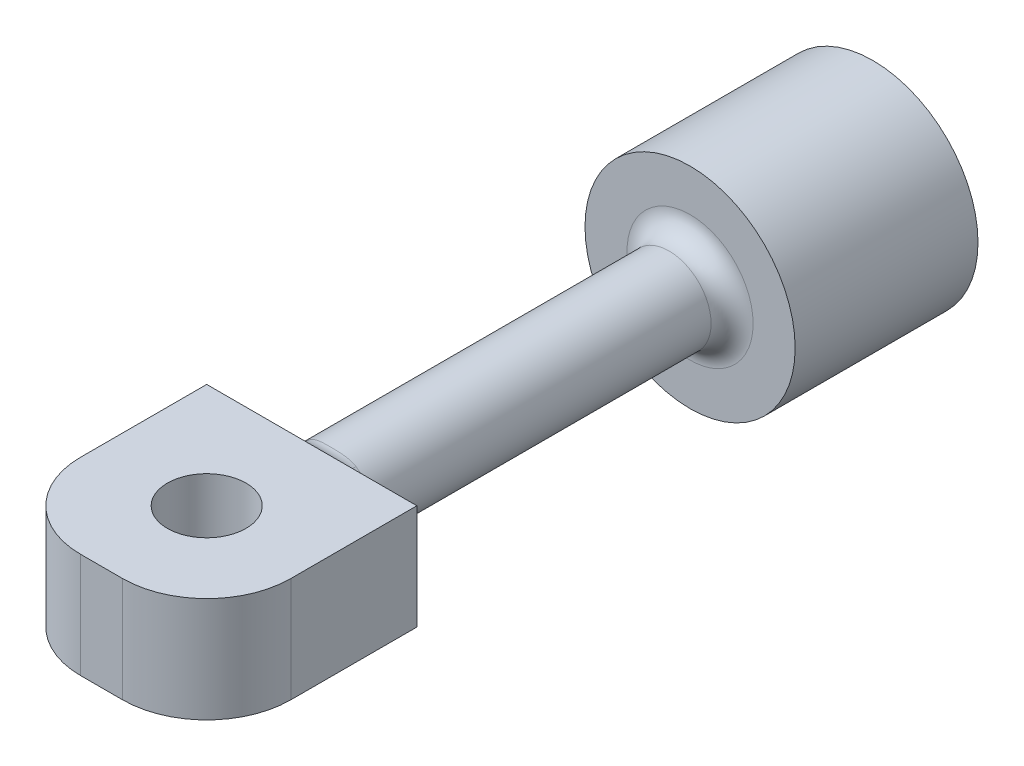
ISO-10303-21;
HEADER;
FILE_DESCRIPTION(('STEP AP214'),'2;1');
FILE_NAME('part.step','',(''),(''),'','','');
FILE_SCHEMA(('AUTOMOTIVE_DESIGN { 1 0 10303 214 1 1 1 1 }'));
ENDSEC;
DATA;
#1=APPLICATION_CONTEXT('core data for automotive mechanical design processes');
#2=APPLICATION_PROTOCOL_DEFINITION('international standard','automotive_design',2000,#1);
#3=PRODUCT_CONTEXT('',#1,'mechanical');
#4=PRODUCT('Part','Part','',(#3));
#5=PRODUCT_RELATED_PRODUCT_CATEGORY('part','',(#4));
#6=PRODUCT_DEFINITION_FORMATION('','',#4);
#7=PRODUCT_DEFINITION_CONTEXT('part definition',#1,'design');
#8=PRODUCT_DEFINITION('design','',#6,#7);
#9=PRODUCT_DEFINITION_SHAPE('','',#8);
#10=(LENGTH_UNIT() NAMED_UNIT(*) SI_UNIT(.MILLI.,.METRE.));
#11=(NAMED_UNIT(*) PLANE_ANGLE_UNIT() SI_UNIT($,.RADIAN.));
#12=(NAMED_UNIT(*) SI_UNIT($,.STERADIAN.) SOLID_ANGLE_UNIT());
#13=UNCERTAINTY_MEASURE_WITH_UNIT(LENGTH_MEASURE(1.E-05),#10,'distance_accuracy_value','');
#14=(GEOMETRIC_REPRESENTATION_CONTEXT(3) GLOBAL_UNCERTAINTY_ASSIGNED_CONTEXT((#13)) GLOBAL_UNIT_ASSIGNED_CONTEXT((#10,
#11,#12)) REPRESENTATION_CONTEXT('',''));
#15=CARTESIAN_POINT('',(0.,0.,0.));
#16=DIRECTION('',(0.,0.,1.));
#17=DIRECTION('',(1.,0.,0.));
#18=AXIS2_PLACEMENT_3D('',#15,#16,#17);
#19=CARTESIAN_POINT('',(0.,0.,33.909));
#20=DIRECTION('',(0.,0.,1.));
#21=DIRECTION('',(1.,0.,0.));
#22=AXIS2_PLACEMENT_3D('',#19,#20,#21);
#23=PLANE('',#22);
#24=DIRECTION('',(-1.,0.,0.));
#25=VECTOR('',#24,1.);
#26=CARTESIAN_POINT('',(-6.35,3.175,33.909));
#27=LINE('',#26,#25);
#28=CARTESIAN_POINT('',(-2.10605674187568,3.175,33.909));
#29=VERTEX_POINT('',#28);
#30=CARTESIAN_POINT('',(-6.35,3.175,33.909));
#31=VERTEX_POINT('',#30);
#32=EDGE_CURVE('E150',#29,#31,#27,.T.);
#33=ORIENTED_EDGE('',*,*,#32,.F.);
#34=CARTESIAN_POINT('',(0.,0.,33.909));
#35=DIRECTION('',(0.,0.,1.));
#36=DIRECTION('',(1.,0.,0.));
#37=AXIS2_PLACEMENT_3D('',#34,#35,#36);
#38=CIRCLE('',#37,3.81);
#39=CARTESIAN_POINT('',(-2.10605674187568,-3.175,33.909));
#40=VERTEX_POINT('',#39);
#41=EDGE_CURVE('E11',#29,#40,#38,.T.);
#42=ORIENTED_EDGE('',*,*,#41,.T.);
#43=DIRECTION('',(1.,0.,0.));
#44=VECTOR('',#43,1.);
#45=CARTESIAN_POINT('',(-6.35,-3.175,33.909));
#46=LINE('',#45,#44);
#47=CARTESIAN_POINT('',(-6.35,-3.175,33.909));
#48=VERTEX_POINT('',#47);
#49=EDGE_CURVE('E171',#48,#40,#46,.T.);
#50=ORIENTED_EDGE('',*,*,#49,.F.);
#51=DIRECTION('',(0.,-1.,0.));
#52=VECTOR('',#51,1.);
#53=CARTESIAN_POINT('',(-6.35,3.175,33.909));
#54=LINE('',#53,#52);
#55=EDGE_CURVE('E147',#31,#48,#54,.T.);
#56=ORIENTED_EDGE('',*,*,#55,.F.);
#57=EDGE_LOOP('',(#33,#42,#50,#56));
#58=FACE_BOUND('',#57,.T.);
#59=ADVANCED_FACE('F44',(#58),#23,.F.);
#60=CARTESIAN_POINT('',(0.,0.,11.049));
#61=DIRECTION('',(0.,0.,-1.));
#62=DIRECTION('',(-1.,0.,0.));
#63=AXIS2_PLACEMENT_3D('',#60,#61,#62);
#64=CYLINDRICAL_SURFACE('',#63,6.35);
#65=CARTESIAN_POINT('',(0.,0.,11.049));
#66=DIRECTION('',(0.,0.,1.));
#67=DIRECTION('',(1.,0.,0.));
#68=AXIS2_PLACEMENT_3D('',#65,#66,#67);
#69=CIRCLE('',#68,6.35);
#70=CARTESIAN_POINT('',(6.35,0.,11.049));
#71=VERTEX_POINT('',#70);
#72=EDGE_CURVE('E185',#71,#71,#69,.T.);
#73=ORIENTED_EDGE('',*,*,#72,.F.);
#74=EDGE_LOOP('',(#73));
#75=FACE_BOUND('',#74,.T.);
#76=CARTESIAN_POINT('',(0.,0.,0.));
#77=DIRECTION('',(0.,0.,1.));
#78=DIRECTION('',(1.,0.,0.));
#79=AXIS2_PLACEMENT_3D('',#76,#77,#78);
#80=CIRCLE('',#79,6.35);
#81=CARTESIAN_POINT('',(6.35,0.,0.));
#82=VERTEX_POINT('',#81);
#83=EDGE_CURVE('E140',#82,#82,#80,.T.);
#84=ORIENTED_EDGE('',*,*,#83,.T.);
#85=EDGE_LOOP('',(#84));
#86=FACE_BOUND('',#85,.T.);
#87=ADVANCED_FACE('F362',(#75,#86),#64,.T.);
#88=CARTESIAN_POINT('',(0.,0.,11.049));
#89=DIRECTION('',(0.,0.,1.));
#90=DIRECTION('',(1.,0.,0.));
#91=AXIS2_PLACEMENT_3D('',#88,#89,#90);
#92=PLANE('',#91);
#93=CARTESIAN_POINT('',(0.,0.,11.049));
#94=DIRECTION('',(0.,0.,1.));
#95=DIRECTION('',(1.,0.,0.));
#96=AXIS2_PLACEMENT_3D('',#93,#94,#95);
#97=CIRCLE('',#96,3.81);
#98=CARTESIAN_POINT('',(3.81,0.,11.049));
#99=VERTEX_POINT('',#98);
#100=EDGE_CURVE('E307',#99,#99,#97,.F.);
#101=ORIENTED_EDGE('',*,*,#100,.T.);
#102=EDGE_LOOP('',(#101));
#103=FACE_BOUND('',#102,.T.);
#104=ORIENTED_EDGE('',*,*,#72,.T.);
#105=EDGE_LOOP('',(#104));
#106=FACE_BOUND('',#105,.T.);
#107=ADVANCED_FACE('F366',(#103,#106),#92,.T.);
#108=CARTESIAN_POINT('',(0.,0.,0.));
#109=DIRECTION('',(0.,0.,1.));
#110=DIRECTION('',(1.,0.,0.));
#111=AXIS2_PLACEMENT_3D('',#108,#109,#110);
#112=PLANE('',#111);
#113=ORIENTED_EDGE('',*,*,#83,.F.);
#114=EDGE_LOOP('',(#113));
#115=FACE_BOUND('',#114,.T.);
#116=ADVANCED_FACE('F371',(#115),#112,.F.);
#117=CARTESIAN_POINT('',(0.,0.,33.909));
#118=DIRECTION('',(0.,0.,-1.));
#119=DIRECTION('',(-1.,0.,0.));
#120=AXIS2_PLACEMENT_3D('',#117,#118,#119);
#121=CYLINDRICAL_SURFACE('',#120,2.54);
#122=CARTESIAN_POINT('',(0.,0.,12.319));
#123=DIRECTION('',(0.,0.,1.));
#124=DIRECTION('',(1.,0.,0.));
#125=AXIS2_PLACEMENT_3D('',#122,#123,#124);
#126=CIRCLE('',#125,2.54);
#127=CARTESIAN_POINT('',(2.54,0.,12.319));
#128=VERTEX_POINT('',#127);
#129=EDGE_CURVE('E311',#128,#128,#126,.T.);
#130=ORIENTED_EDGE('',*,*,#129,.T.);
#131=EDGE_LOOP('',(#130));
#132=FACE_BOUND('',#131,.T.);
#133=CARTESIAN_POINT('',(2.75747346033165,3.175,33.909));
#134=CARTESIAN_POINT('',(1.45075360666102,2.15924582636556,34.3925103205279));
#135=CARTESIAN_POINT('',(1.8383156402211,1.75276798433748,32.762287335359));
#136=CARTESIAN_POINT('',(2.72145797705879,3.175,33.909));
#137=CARTESIAN_POINT('',(1.4619449534235,2.1364571380609,34.3627104337745));
#138=CARTESIAN_POINT('',(1.81430531803398,1.77796123271911,32.7443061096109));
#139=CARTESIAN_POINT('',(2.68412922378728,3.175,33.909));
#140=CARTESIAN_POINT('',(1.47073248027829,2.11840312635964,34.3306632550964));
#141=CARTESIAN_POINT('',(1.78941948251894,1.80301384779414,32.7287001018676));
#142=CARTESIAN_POINT('',(2.60721213015224,3.175,33.909));
#143=CARTESIAN_POINT('',(1.48263257214973,2.09138260314045,34.2651764844754));
#144=CARTESIAN_POINT('',(1.73814142009749,1.85249078486686,32.7017579648089));
#145=CARTESIAN_POINT('',(2.56762839040957,3.175,33.909));
#146=CARTESIAN_POINT('',(1.48588018624446,2.08220364788548,34.231802792635));
#147=CARTESIAN_POINT('',(1.71175226027164,1.87691624833565,32.6904134767656));
#148=CARTESIAN_POINT('',(2.44674360913777,3.175,33.909));
#149=CARTESIAN_POINT('',(1.48674334836591,2.06657196841838,34.1346097553019));
#150=CARTESIAN_POINT('',(1.63116240609462,1.94833753668744,32.6621789642376));
#151=CARTESIAN_POINT('',(2.3624790921311,3.175,33.909));
#152=CARTESIAN_POINT('',(1.47653785253469,2.07020606843899,34.0706978369796));
#153=CARTESIAN_POINT('',(1.57498606142162,1.99406237736209,32.6507044916589));
#154=CARTESIAN_POINT('',(2.1410703829851,3.175,33.909));
#155=CARTESIAN_POINT('',(1.42414088680289,2.10221098403041,33.9257559973822));
#156=CARTESIAN_POINT('',(1.42738025532204,2.10395038816791,32.6351701860049));
#157=CARTESIAN_POINT('',(1.99982997151836,3.175,33.909));
#158=CARTESIAN_POINT('',(1.36923366618578,2.14127021575293,33.8496502471815));
#159=CARTESIAN_POINT('',(1.33321998101189,2.16482858767716,32.6384013643611));
#160=CARTESIAN_POINT('',(1.70667074867858,3.175,33.909));
#161=CARTESIAN_POINT('',(1.22391730797736,2.22907432847525,33.7301349698206));
#162=CARTESIAN_POINT('',(1.13778049911941,2.27370249296661,32.6583169592671));
#163=CARTESIAN_POINT('',(1.55468546483664,3.175,33.909));
#164=CARTESIAN_POINT('',(1.13434514523384,2.27783580065136,33.684666092897));
#165=CARTESIAN_POINT('',(1.0364569765578,2.32160717117294,32.6750933064768));
#166=CARTESIAN_POINT('',(1.23295718880419,3.175,33.909));
#167=CARTESIAN_POINT('',(0.926866541861878,2.37010033517938,33.6155588797758));
#168=CARTESIAN_POINT('',(0.821971459202746,2.40625619806118,32.7136356489396));
#169=CARTESIAN_POINT('',(1.06270036998937,3.175,33.909));
#170=CARTESIAN_POINT('',(0.806864110490198,2.41413776676252,33.5919187450191));
#171=CARTESIAN_POINT('',(0.708466913326457,2.44208870148717,32.7356524902216));
#172=CARTESIAN_POINT('',(0.802850613272052,3.175,33.909));
#173=CARTESIAN_POINT('',(0.615600478159448,2.46650168060619,33.5681089924189));
#174=CARTESIAN_POINT('',(0.535233742181263,2.48367535672255,32.7642961639842));
#175=CARTESIAN_POINT('',(0.715600296142354,3.175,33.909));
#176=CARTESIAN_POINT('',(0.550403207057633,2.48168354496009,33.5620685227564));
#177=CARTESIAN_POINT('',(0.477066864094577,2.49550343318059,32.7731056136815));
#178=CARTESIAN_POINT('',(0.539873346842566,3.175,33.909));
#179=CARTESIAN_POINT('',(0.417599545586189,2.50699110839662,33.5527188341097));
#180=CARTESIAN_POINT('',(0.359915564561384,2.51507142565873,32.7882674505011));
#181=CARTESIAN_POINT('',(0.451397155316291,3.175,33.909));
#182=CARTESIAN_POINT('',(0.34977097576357,2.51721062537906,33.5493668970072));
#183=CARTESIAN_POINT('',(0.300931436877421,2.52281277344814,32.7946206979351));
#184=CARTESIAN_POINT('',(0.257633820372502,3.175,33.909));
#185=CARTESIAN_POINT('',(0.20052219015659,2.53350557205262,33.5442223062246));
#186=CARTESIAN_POINT('',(0.171755880248457,2.53515927163514,32.8049249501876));
#187=CARTESIAN_POINT('',(0.152191542896029,3.175,33.909));
#188=CARTESIAN_POINT('',(0.118388680708993,2.53859571542163,33.5427881251985));
#189=CARTESIAN_POINT('',(0.101461028597438,2.53894743153238,32.808236395569));
#190=CARTESIAN_POINT('',(-0.0588439476512452,3.175,33.909));
#191=CARTESIAN_POINT('',(-0.0457236454247866,2.54089515488794,33.5421241175975));
#192=CARTESIAN_POINT('',(-0.0392292984342492,2.54067137423043,32.8097290540229));
#193=CARTESIAN_POINT('',(-0.164437172904387,3.175,33.909));
#194=CARTESIAN_POINT('',(-0.128144441372206,2.53811621016374,33.5428909457727));
#195=CARTESIAN_POINT('',(-0.109624781936479,2.53860665450393,32.8079098265766));
#196=CARTESIAN_POINT('',(-0.375134437884289,3.175,33.909));
#197=CARTESIAN_POINT('',(-0.291191200794401,2.52489593997202,33.5469030657575));
#198=CARTESIAN_POINT('',(-0.250089625255972,2.52864167150419,32.7994527065369));
#199=CARTESIAN_POINT('',(-0.480235902219539,3.175,33.909));
#200=CARTESIAN_POINT('',(-0.372241171557344,2.51435942355359,33.5501784384892));
#201=CARTESIAN_POINT('',(-0.320157268145559,2.52072311386589,32.7927997086069));
#202=CARTESIAN_POINT('',(-0.688772361635576,3.175,33.909));
#203=CARTESIAN_POINT('',(-0.530475009564656,2.48633248453244,33.5602337205924));
#204=CARTESIAN_POINT('',(-0.459181574423796,2.49914052659052,32.7758264506634));
#205=CARTESIAN_POINT('',(-0.792207253663055,3.175,33.909));
#206=CARTESIAN_POINT('',(-0.608039298474719,2.468697060834,33.5670759119238));
#207=CARTESIAN_POINT('',(-0.528138169110239,2.48547614306246,32.7655059647719));
#208=CARTESIAN_POINT('',(-1.08102047728346,3.175,33.909));
#209=CARTESIAN_POINT('',(-0.820428628133336,2.41018525109081,33.5937840228559));
#210=CARTESIAN_POINT('',(-0.720680318186171,2.43897203089037,32.7335645468445));
#211=CARTESIAN_POINT('',(-1.26383869884293,3.175,33.909));
#212=CARTESIAN_POINT('',(-0.948845354349257,2.36181615097928,33.6200650298272));
#213=CARTESIAN_POINT('',(-0.842559132546411,2.39960403191938,32.7096298567921));
#214=CARTESIAN_POINT('',(-1.61836923396855,3.175,33.909));
#215=CARTESIAN_POINT('',(-1.17397398571186,2.25823492815116,33.7015655950387));
#216=CARTESIAN_POINT('',(-1.07891282266116,2.3029852734753,32.6678481808692));
#217=CARTESIAN_POINT('',(-1.79013250310725,3.175,33.909));
#218=CARTESIAN_POINT('',(-1.27118984233523,2.20186556768394,33.7587127825564));
#219=CARTESIAN_POINT('',(-1.19342166879709,2.24582490508662,32.6499713570588));
#220=CARTESIAN_POINT('',(-2.0566142211182,3.175,33.909));
#221=CARTESIAN_POINT('',(-1.38914589027986,2.12717702306518,33.8803251554777));
#222=CARTESIAN_POINT('',(-1.37107614737573,2.13962315517979,32.6380108959743));
#223=CARTESIAN_POINT('',(-2.15568332115343,3.175,33.909));
#224=CARTESIAN_POINT('',(-1.42513559033852,2.10219868982999,33.9356213641979));
#225=CARTESIAN_POINT('',(-1.43712221399043,2.09583194074454,32.6374439142818));
#226=CARTESIAN_POINT('',(-2.29937534719872,3.175,33.909));
#227=CARTESIAN_POINT('',(-1.46182244061619,2.07900024101459,34.0274930819406));
#228=CARTESIAN_POINT('',(-1.53291689806266,2.02567263231361,32.6458611282743));
#229=CARTESIAN_POINT('',(-2.34662112284787,3.175,33.909));
#230=CARTESIAN_POINT('',(-1.47119060673998,2.07367961547336,34.0604137288786));
#231=CARTESIAN_POINT('',(-1.56441408186909,2.00144186745873,32.6502454036791));
#232=CARTESIAN_POINT('',(-2.43913130996258,3.175,33.909));
#233=CARTESIAN_POINT('',(-1.48366955631215,2.06969009583306,34.1286792504366));
#234=CARTESIAN_POINT('',(-1.62608753999992,1.95167075755933,32.6627751978397));
#235=CARTESIAN_POINT('',(-2.48439247491016,3.175,33.909));
#236=CARTESIAN_POINT('',(-1.48661398449224,2.07119839725305,34.1640913822208));
#237=CARTESIAN_POINT('',(-1.65626164997896,1.92612840501469,32.6709266449294));
#238=CARTESIAN_POINT('',(-2.52848744698442,3.175,33.909));
#239=CARTESIAN_POINT('',(-1.48616480332682,2.07702560245629,34.1995970549083));
#240=CARTESIAN_POINT('',(-1.68565829798961,1.90004107913981,32.6812724046579));
#241=(BOUNDED_SURFACE() B_SPLINE_SURFACE(3,2,((#133,#134,#135),(#136,#137,#138),(#139,#140,
#141),(#142,#143,#144),(#145,#146,#147),(#148,#149,#150),(#151,#152,#153),(#154,#155,#156),
(#157,#158,#159),(#160,#161,#162),(#163,#164,#165),(#166,#167,#168),(#169,#170,#171),(#172,#173,
#174),(#175,#176,#177),(#178,#179,#180),(#181,#182,#183),(#184,#185,#186),(#187,#188,#189),
(#190,#191,#192),(#193,#194,#195),(#196,#197,#198),(#199,#200,#201),(#202,#203,#204),(#205,#206,
#207),(#208,#209,#210),(#211,#212,#213),(#214,#215,#216),(#217,#218,#219),(#220,#221,#222),
(#223,#224,#225),(#226,#227,#228),(#229,#230,#231),(#232,#233,#234),(#235,#236,#237),(#238,#239,
#240)),.UNSPECIFIED.,.F.,.F.,.F.) B_SPLINE_SURFACE_WITH_KNOTS((4,2,2,2,2,2,2,2,2,2,2,2,2,2,2,2,
2,4),(3,3),(0.,0.165478964280865,0.330631634870746,0.657187123329499,1.15911064900215,
1.66446964051091,2.20221153747686,2.47042166305056,2.73853775979549,3.05498965599523,
3.37146872352753,3.68894105243304,4.00643293763199,4.58500515335889,5.16068472701099,
5.51628394310174,5.69542592105601,5.87485077670779),(0.,1.),
.UNSPECIFIED.) GEOMETRIC_REPRESENTATION_ITEM() RATIONAL_B_SPLINE_SURFACE(((1.,0.593046572981363,
1.),(1.,0.599903529057048,1.),(1.,0.606980350720252,1.),(1.,0.621392399509858,1.),(1.,
0.628727089593793,1.),(1.,0.650721583165667,1.),(1.,0.665534782996795,1.),(1.,0.702309478093336,
1.),(1.,0.723837732724251,1.),(1.,0.763359635592699,1.),(1.,0.781328082295264,1.),(1.,
0.81353929178972,1.),(1.,0.827469535836317,1.),(1.,0.84375223507824,1.),(1.,0.848408111753961,
1.),(1.,0.856131724328274,1.),(1.,0.859200016423386,1.),(1.,0.864098930789858,1.),(1.,
0.865606705247396,1.),(1.,0.866292473729694,1.),(1.,0.865470267702701,1.),(1.,0.861511666313443,
1.),(1.,0.858368016026511,1.),(1.,0.849840328339414,1.),(1.,0.844456152943346,1.),(1.,
0.826251623547143,1.),(1.,0.810957187187147,1.),(1.,0.774307157851412,1.),(1.,0.752982250667473,
1.),(1.,0.715018996161015,1.),(1.,0.699705643124637,1.),(1.,0.676076182482073,1.),(1.,
0.668058615733603,1.),(1.,0.651959945216799,1.),(1.,0.643878761110568,1.),(1.,0.635848556141678,1.))) REPRESENTATION_ITEM('') SURFACE());
#242=CARTESIAN_POINT('',(-1.68565829798961,1.90004107913981,32.6812724046579));
#243=CARTESIAN_POINT('',(-1.65626164997896,1.92612840501469,32.6709266449294));
#244=CARTESIAN_POINT('',(-1.62608753999992,1.95167075755933,32.6627751978397));
#245=CARTESIAN_POINT('',(-1.56441408186909,2.00144186745873,32.6502454036791));
#246=CARTESIAN_POINT('',(-1.53291689806266,2.02567263231361,32.6458611282743));
#247=CARTESIAN_POINT('',(-1.43712221399043,2.09583194074454,32.6374439142818));
#248=CARTESIAN_POINT('',(-1.37107614737573,2.13962315517979,32.6380108959743));
#249=CARTESIAN_POINT('',(-1.19342166879709,2.24582490508662,32.6499713570588));
#250=CARTESIAN_POINT('',(-1.07891282266116,2.3029852734753,32.6678481808692));
#251=CARTESIAN_POINT('',(-0.842559132546411,2.39960403191938,32.7096298567921));
#252=CARTESIAN_POINT('',(-0.720680318186171,2.43897203089037,32.7335645468445));
#253=CARTESIAN_POINT('',(-0.528138169110239,2.48547614306246,32.7655059647719));
#254=CARTESIAN_POINT('',(-0.459181574423796,2.49914052659052,32.7758264506634));
#255=CARTESIAN_POINT('',(-0.320157268145559,2.52072311386589,32.7927997086069));
#256=CARTESIAN_POINT('',(-0.250089625255972,2.52864167150419,32.7994527065369));
#257=CARTESIAN_POINT('',(-0.109624781936479,2.53860665450393,32.8079098265766));
#258=CARTESIAN_POINT('',(-0.0392292984342491,2.54067137423043,32.8097290540229));
#259=CARTESIAN_POINT('',(0.101461028597438,2.53894743153238,32.808236395569));
#260=CARTESIAN_POINT('',(0.171755880248457,2.53515927163514,32.8049249501876));
#261=CARTESIAN_POINT('',(0.300931436877421,2.52281277344814,32.7946206979351));
#262=CARTESIAN_POINT('',(0.359915564561384,2.51507142565873,32.7882674505011));
#263=CARTESIAN_POINT('',(0.477066864094577,2.49550343318059,32.7731056136815));
#264=CARTESIAN_POINT('',(0.535233742181263,2.48367535672255,32.7642961639842));
#265=CARTESIAN_POINT('',(0.708466913326457,2.44208870148717,32.7356524902216));
#266=CARTESIAN_POINT('',(0.821971459202746,2.40625619806118,32.7136356489396));
#267=CARTESIAN_POINT('',(1.0364569765578,2.32160717117294,32.6750933064768));
#268=CARTESIAN_POINT('',(1.13778049911941,2.27370249296661,32.6583169592671));
#269=CARTESIAN_POINT('',(1.33321998101189,2.16482858767716,32.6384013643611));
#270=CARTESIAN_POINT('',(1.42738025532204,2.10395038816791,32.6351701860049));
#271=CARTESIAN_POINT('',(1.57498606142162,1.99406237736209,32.6507044916589));
#272=CARTESIAN_POINT('',(1.63116240609462,1.94833753668744,32.6621789642376));
#273=CARTESIAN_POINT('',(1.71175226027164,1.87691624833565,32.6904134767656));
#274=CARTESIAN_POINT('',(1.73814142009749,1.85249078486686,32.7017579648089));
#275=CARTESIAN_POINT('',(1.78941948251894,1.80301384779414,32.7287001018676));
#276=CARTESIAN_POINT('',(1.81430531803398,1.7779612327191,32.7443061096109));
#277=CARTESIAN_POINT('',(1.8383156402211,1.75276798433748,32.762287335359));
#278=B_SPLINE_CURVE_WITH_KNOTS('',3,(#242,#243,#244,#245,#246,#247,#248,#249,#250,#251,#252,
#253,#254,#255,#256,#257,#258,#259,#260,#261,#262,#263,#264,#265,#266,#267,#268,#269,#270,#271,
#272,#273,#274,#275,#276,#277),.UNSPECIFIED.,.F.,.F.,(4,2,2,2,2,2,2,2,2,2,2,2,2,2,2,2,2,4),(0.,
0.17942485565178,0.358566833606047,0.714166049696798,1.2898456233489,1.86841783907579,
2.18590972427475,2.50338205318026,2.81986112071256,3.13631301691229,3.40442911365723,
3.67263923923093,4.21038113619688,4.71574012770563,5.21766365337829,5.54421914183704,
5.70937181242692,5.87485077670779),.UNSPECIFIED.);
#279=CARTESIAN_POINT('',(-1.40403782791712,2.11666666666667,32.639));
#280=VERTEX_POINT('',#279);
#281=CARTESIAN_POINT('',(1.40403782791712,2.11666666666667,32.639));
#282=VERTEX_POINT('',#281);
#283=EDGE_CURVE('E217',#280,#282,#278,.T.);
#284=ORIENTED_EDGE('',*,*,#283,.T.);
#285=CARTESIAN_POINT('',(0.,0.,32.639));
#286=DIRECTION('',(0.,0.,1.));
#287=DIRECTION('',(1.,0.,0.));
#288=AXIS2_PLACEMENT_3D('',#285,#286,#287);
#289=CIRCLE('',#288,2.54);
#290=CARTESIAN_POINT('',(1.40403782791712,-2.11666666666667,32.639));
#291=VERTEX_POINT('',#290);
#292=EDGE_CURVE('E315',#282,#291,#289,.F.);
#293=ORIENTED_EDGE('',*,*,#292,.T.);
#294=CARTESIAN_POINT('',(-2.75747346033165,-3.175,33.909));
#295=CARTESIAN_POINT('',(-1.45075360666101,-2.15924582636556,34.3925103205279));
#296=CARTESIAN_POINT('',(-1.8383156402211,-1.75276798433748,32.762287335359));
#297=CARTESIAN_POINT('',(-2.72145797705878,-3.175,33.909));
#298=CARTESIAN_POINT('',(-1.4619449534235,-2.1364571380609,34.3627104337745));
#299=CARTESIAN_POINT('',(-1.81430531803398,-1.77796123271911,32.7443061096109));
#300=CARTESIAN_POINT('',(-2.68412922378728,-3.175,33.909));
#301=CARTESIAN_POINT('',(-1.47073248027829,-2.11840312635964,34.3306632550964));
#302=CARTESIAN_POINT('',(-1.78941948251894,-1.80301384779414,32.7287001018676));
#303=CARTESIAN_POINT('',(-2.60721213015224,-3.175,33.909));
#304=CARTESIAN_POINT('',(-1.48263257214973,-2.09138260314045,34.2651764844754));
#305=CARTESIAN_POINT('',(-1.73814142009749,-1.85249078486686,32.7017579648089));
#306=CARTESIAN_POINT('',(-2.56762839040957,-3.175,33.909));
#307=CARTESIAN_POINT('',(-1.48588018624446,-2.08220364788548,34.231802792635));
#308=CARTESIAN_POINT('',(-1.71175226027164,-1.87691624833565,32.6904134767656));
#309=CARTESIAN_POINT('',(-2.44674360913777,-3.175,33.909));
#310=CARTESIAN_POINT('',(-1.48674334836591,-2.06657196841838,34.1346097553019));
#311=CARTESIAN_POINT('',(-1.63116240609462,-1.94833753668744,32.6621789642376));
#312=CARTESIAN_POINT('',(-2.3624790921311,-3.175,33.909));
#313=CARTESIAN_POINT('',(-1.47653785253469,-2.07020606843899,34.0706978369796));
#314=CARTESIAN_POINT('',(-1.57498606142162,-1.99406237736209,32.6507044916589));
#315=CARTESIAN_POINT('',(-2.1410703829851,-3.175,33.909));
#316=CARTESIAN_POINT('',(-1.42414088680289,-2.10221098403041,33.9257559973822));
#317=CARTESIAN_POINT('',(-1.42738025532204,-2.10395038816791,32.6351701860049));
#318=CARTESIAN_POINT('',(-1.99982997151836,-3.175,33.909));
#319=CARTESIAN_POINT('',(-1.36923366618578,-2.14127021575293,33.8496502471815));
#320=CARTESIAN_POINT('',(-1.33321998101189,-2.16482858767716,32.6384013643611));
#321=CARTESIAN_POINT('',(-1.70667074867858,-3.175,33.909));
#322=CARTESIAN_POINT('',(-1.22391730797736,-2.22907432847525,33.7301349698206));
#323=CARTESIAN_POINT('',(-1.13778049911941,-2.27370249296661,32.6583169592671));
#324=CARTESIAN_POINT('',(-1.55468546483664,-3.175,33.909));
#325=CARTESIAN_POINT('',(-1.13434514523384,-2.27783580065136,33.684666092897));
#326=CARTESIAN_POINT('',(-1.0364569765578,-2.32160717117294,32.6750933064768));
#327=CARTESIAN_POINT('',(-1.23295718880419,-3.175,33.909));
#328=CARTESIAN_POINT('',(-0.926866541861877,-2.37010033517938,33.6155588797758));
#329=CARTESIAN_POINT('',(-0.821971459202746,-2.40625619806118,32.7136356489396));
#330=CARTESIAN_POINT('',(-1.06270036998937,-3.175,33.909));
#331=CARTESIAN_POINT('',(-0.806864110490197,-2.41413776676252,33.5919187450191));
#332=CARTESIAN_POINT('',(-0.708466913326456,-2.44208870148717,32.7356524902216));
#333=CARTESIAN_POINT('',(-0.802850613272051,-3.175,33.909));
#334=CARTESIAN_POINT('',(-0.615600478159447,-2.46650168060619,33.5681089924189));
#335=CARTESIAN_POINT('',(-0.535233742181263,-2.48367535672255,32.7642961639842));
#336=CARTESIAN_POINT('',(-0.715600296142354,-3.175,33.909));
#337=CARTESIAN_POINT('',(-0.550403207057633,-2.48168354496009,33.5620685227564));
#338=CARTESIAN_POINT('',(-0.477066864094577,-2.49550343318059,32.7731056136815));
#339=CARTESIAN_POINT('',(-0.539873346842567,-3.175,33.909));
#340=CARTESIAN_POINT('',(-0.417599545586189,-2.50699110839662,33.5527188341097));
#341=CARTESIAN_POINT('',(-0.359915564561385,-2.51507142565873,32.7882674505011));
#342=CARTESIAN_POINT('',(-0.451397155316291,-3.175,33.909));
#343=CARTESIAN_POINT('',(-0.34977097576357,-2.51721062537906,33.5493668970072));
#344=CARTESIAN_POINT('',(-0.300931436877421,-2.52281277344814,32.7946206979351));
#345=CARTESIAN_POINT('',(-0.257633820372501,-3.175,33.909));
#346=CARTESIAN_POINT('',(-0.200522190156589,-2.53350557205262,33.5442223062246));
#347=CARTESIAN_POINT('',(-0.171755880248456,-2.53515927163514,32.8049249501876));
#348=CARTESIAN_POINT('',(-0.152191542896028,-3.175,33.909));
#349=CARTESIAN_POINT('',(-0.118388680708992,-2.53859571542163,33.5427881251985));
#350=CARTESIAN_POINT('',(-0.101461028597438,-2.53894743153238,32.808236395569));
#351=CARTESIAN_POINT('',(0.0588439476512474,-3.175,33.909));
#352=CARTESIAN_POINT('',(0.0457236454247882,-2.54089515488794,33.5421241175976));
#353=CARTESIAN_POINT('',(0.0392292984342506,-2.54067137423043,32.8097290540229));
#354=CARTESIAN_POINT('',(0.16443717290439,-3.175,33.909));
#355=CARTESIAN_POINT('',(0.128144441372209,-2.53811621016374,33.5428909457727));
#356=CARTESIAN_POINT('',(0.10962478193648,-2.53860665450393,32.8079098265766));
#357=CARTESIAN_POINT('',(0.375134437884293,-3.175,33.909));
#358=CARTESIAN_POINT('',(0.291191200794404,-2.52489593997202,33.5469030657575));
#359=CARTESIAN_POINT('',(0.250089625255974,-2.52864167150419,32.7994527065369));
#360=CARTESIAN_POINT('',(0.480235902219543,-3.175,33.909));
#361=CARTESIAN_POINT('',(0.372241171557347,-2.5143594235536,33.5501784384892));
#362=CARTESIAN_POINT('',(0.320157268145562,-2.52072311386589,32.7927997086069));
#363=CARTESIAN_POINT('',(0.688772361635581,-3.175,33.909));
#364=CARTESIAN_POINT('',(0.53047500956466,-2.48633248453244,33.5602337205924));
#365=CARTESIAN_POINT('',(0.459181574423799,-2.49914052659052,32.7758264506634));
#366=CARTESIAN_POINT('',(0.79220725366306,-3.175,33.909));
#367=CARTESIAN_POINT('',(0.608039298474723,-2.468697060834,33.5670759119238));
#368=CARTESIAN_POINT('',(0.528138169110243,-2.48547614306246,32.7655059647719));
#369=CARTESIAN_POINT('',(1.08102047728346,-3.175,33.909));
#370=CARTESIAN_POINT('',(0.82042862813334,-2.41018525109081,33.5937840228559));
#371=CARTESIAN_POINT('',(0.720680318186175,-2.43897203089037,32.7335645468445));
#372=CARTESIAN_POINT('',(1.26383869884293,-3.175,33.909));
#373=CARTESIAN_POINT('',(0.948845354349262,-2.36181615097928,33.6200650298272));
#374=CARTESIAN_POINT('',(0.842559132546416,-2.39960403191937,32.7096298567921));
#375=CARTESIAN_POINT('',(1.61836923396856,-3.175,33.909));
#376=CARTESIAN_POINT('',(1.17397398571187,-2.25823492815116,33.7015655950387));
#377=CARTESIAN_POINT('',(1.07891282266117,-2.3029852734753,32.6678481808692));
#378=CARTESIAN_POINT('',(1.79013250310726,-3.175,33.909));
#379=CARTESIAN_POINT('',(1.27118984233523,-2.20186556768393,33.7587127825564));
#380=CARTESIAN_POINT('',(1.1934216687971,-2.24582490508662,32.6499713570588));
#381=CARTESIAN_POINT('',(2.0566142211182,-3.175,33.909));
#382=CARTESIAN_POINT('',(1.38914589027986,-2.12717702306518,33.8803251554778));
#383=CARTESIAN_POINT('',(1.37107614737574,-2.13962315517979,32.6380108959743));
#384=CARTESIAN_POINT('',(2.15568332115344,-3.175,33.909));
#385=CARTESIAN_POINT('',(1.42513559033852,-2.10219868982999,33.9356213641978));
#386=CARTESIAN_POINT('',(1.43712221399043,-2.09583194074453,32.6374439142818));
#387=CARTESIAN_POINT('',(2.29937534719873,-3.175,33.909));
#388=CARTESIAN_POINT('',(1.46182244061619,-2.07900024101459,34.0274930819406));
#389=CARTESIAN_POINT('',(1.53291689806267,-2.02567263231361,32.6458611282743));
#390=CARTESIAN_POINT('',(2.34662112284788,-3.175,33.909));
#391=CARTESIAN_POINT('',(1.47119060673998,-2.07367961547336,34.0604137288786));
#392=CARTESIAN_POINT('',(1.5644140818691,-2.00144186745872,32.6502454036791));
#393=CARTESIAN_POINT('',(2.43913130996259,-3.175,33.909));
#394=CARTESIAN_POINT('',(1.48366955631215,-2.06969009583306,34.1286792504366));
#395=CARTESIAN_POINT('',(1.62608753999993,-1.95167075755932,32.6627751978397));
#396=CARTESIAN_POINT('',(2.48439247491017,-3.175,33.909));
#397=CARTESIAN_POINT('',(1.48661398449224,-2.07119839725305,34.1640913822209));
#398=CARTESIAN_POINT('',(1.65626164997896,-1.92612840501469,32.6709266449294));
#399=CARTESIAN_POINT('',(2.52848744698443,-3.175,33.909));
#400=CARTESIAN_POINT('',(1.48616480332682,-2.07702560245629,34.1995970549083));
#401=CARTESIAN_POINT('',(1.68565829798962,-1.9000410791398,32.6812724046579));
#402=(BOUNDED_SURFACE() B_SPLINE_SURFACE(3,2,((#294,#295,#296),(#297,#298,#299),(#300,#301,
#302),(#303,#304,#305),(#306,#307,#308),(#309,#310,#311),(#312,#313,#314),(#315,#316,#317),
(#318,#319,#320),(#321,#322,#323),(#324,#325,#326),(#327,#328,#329),(#330,#331,#332),(#333,#334,
#335),(#336,#337,#338),(#339,#340,#341),(#342,#343,#344),(#345,#346,#347),(#348,#349,#350),
(#351,#352,#353),(#354,#355,#356),(#357,#358,#359),(#360,#361,#362),(#363,#364,#365),(#366,#367,
#368),(#369,#370,#371),(#372,#373,#374),(#375,#376,#377),(#378,#379,#380),(#381,#382,#383),
(#384,#385,#386),(#387,#388,#389),(#390,#391,#392),(#393,#394,#395),(#396,#397,#398),(#399,#400,
#401)),.UNSPECIFIED.,.F.,.F.,.F.) B_SPLINE_SURFACE_WITH_KNOTS((4,2,2,2,2,2,2,2,2,2,2,2,2,2,2,2,
2,4),(3,3),(0.,0.165478964280865,0.330631634870746,0.657187123329499,1.15911064900215,
1.6644696405109,2.20221153747686,2.47042166305055,2.73853775979549,3.05498965599523,
3.37146872352753,3.68894105243304,4.006432937632,4.58500515335889,5.16068472701099,
5.51628394310174,5.69542592105601,5.87485077670779),(0.,1.),
.UNSPECIFIED.) GEOMETRIC_REPRESENTATION_ITEM() RATIONAL_B_SPLINE_SURFACE(((1.,0.593046572981363,
1.),(1.,0.599903529057048,1.),(1.,0.606980350720252,1.),(1.,0.621392399509858,1.),(1.,
0.628727089593793,1.),(1.,0.650721583165667,1.),(1.,0.665534782996795,1.),(1.,0.702309478093336,
1.),(1.,0.723837732724251,1.),(1.,0.763359635592699,1.),(1.,0.781328082295265,1.),(1.,
0.813539291789719,1.),(1.,0.827469535836316,1.),(1.,0.84375223507824,1.),(1.,0.848408111753961,
1.),(1.,0.856131724328274,1.),(1.,0.859200016423385,1.),(1.,0.864098930789857,1.),(1.,
0.865606705247395,1.),(1.,0.866292473729694,1.),(1.,0.865470267702701,1.),(1.,0.861511666313443,
1.),(1.,0.858368016026511,1.),(1.,0.849840328339414,1.),(1.,0.844456152943345,1.),(1.,
0.826251623547142,1.),(1.,0.810957187187146,1.),(1.,0.774307157851411,1.),(1.,0.752982250667472,
1.),(1.,0.715018996161014,1.),(1.,0.699705643124636,1.),(1.,0.676076182482072,1.),(1.,
0.668058615733602,1.),(1.,0.651959945216798,1.),(1.,0.643878761110567,1.),(1.,0.635848556141677,1.))) REPRESENTATION_ITEM('') SURFACE());
#403=CARTESIAN_POINT('',(1.68565829798962,-1.9000410791398,32.6812724046579));
#404=CARTESIAN_POINT('',(1.65626164997896,-1.92612840501469,32.6709266449294));
#405=CARTESIAN_POINT('',(1.62608753999993,-1.95167075755932,32.6627751978397));
#406=CARTESIAN_POINT('',(1.5644140818691,-2.00144186745872,32.6502454036791));
#407=CARTESIAN_POINT('',(1.53291689806267,-2.02567263231361,32.6458611282743));
#408=CARTESIAN_POINT('',(1.43712221399043,-2.09583194074453,32.6374439142818));
#409=CARTESIAN_POINT('',(1.37107614737574,-2.13962315517979,32.6380108959743));
#410=CARTESIAN_POINT('',(1.1934216687971,-2.24582490508662,32.6499713570588));
#411=CARTESIAN_POINT('',(1.07891282266117,-2.3029852734753,32.6678481808692));
#412=CARTESIAN_POINT('',(0.842559132546416,-2.39960403191937,32.7096298567921));
#413=CARTESIAN_POINT('',(0.720680318186175,-2.43897203089037,32.7335645468445));
#414=CARTESIAN_POINT('',(0.528138169110243,-2.48547614306246,32.7655059647719));
#415=CARTESIAN_POINT('',(0.459181574423799,-2.49914052659052,32.7758264506634));
#416=CARTESIAN_POINT('',(0.320157268145562,-2.52072311386589,32.7927997086069));
#417=CARTESIAN_POINT('',(0.250089625255974,-2.52864167150419,32.7994527065369));
#418=CARTESIAN_POINT('',(0.10962478193648,-2.53860665450393,32.8079098265766));
#419=CARTESIAN_POINT('',(0.0392292984342506,-2.54067137423043,32.8097290540229));
#420=CARTESIAN_POINT('',(-0.101461028597438,-2.53894743153238,32.808236395569));
#421=CARTESIAN_POINT('',(-0.171755880248456,-2.53515927163514,32.8049249501876));
#422=CARTESIAN_POINT('',(-0.300931436877421,-2.52281277344814,32.7946206979351));
#423=CARTESIAN_POINT('',(-0.359915564561385,-2.51507142565873,32.7882674505011));
#424=CARTESIAN_POINT('',(-0.477066864094577,-2.49550343318059,32.7731056136815));
#425=CARTESIAN_POINT('',(-0.535233742181263,-2.48367535672255,32.7642961639842));
#426=CARTESIAN_POINT('',(-0.708466913326456,-2.44208870148717,32.7356524902216));
#427=CARTESIAN_POINT('',(-0.821971459202746,-2.40625619806118,32.7136356489396));
#428=CARTESIAN_POINT('',(-1.0364569765578,-2.32160717117294,32.6750933064768));
#429=CARTESIAN_POINT('',(-1.13778049911941,-2.27370249296661,32.6583169592671));
#430=CARTESIAN_POINT('',(-1.33321998101189,-2.16482858767716,32.6384013643611));
#431=CARTESIAN_POINT('',(-1.42738025532204,-2.10395038816791,32.6351701860049));
#432=CARTESIAN_POINT('',(-1.57498606142162,-1.99406237736209,32.6507044916589));
#433=CARTESIAN_POINT('',(-1.63116240609462,-1.94833753668744,32.6621789642376));
#434=CARTESIAN_POINT('',(-1.71175226027164,-1.87691624833565,32.6904134767656));
#435=CARTESIAN_POINT('',(-1.73814142009749,-1.85249078486686,32.7017579648089));
#436=CARTESIAN_POINT('',(-1.78941948251894,-1.80301384779414,32.7287001018676));
#437=CARTESIAN_POINT('',(-1.81430531803398,-1.77796123271911,32.7443061096109));
#438=CARTESIAN_POINT('',(-1.8383156402211,-1.75276798433748,32.762287335359));
#439=B_SPLINE_CURVE_WITH_KNOTS('',3,(#403,#404,#405,#406,#407,#408,#409,#410,#411,#412,#413,
#414,#415,#416,#417,#418,#419,#420,#421,#422,#423,#424,#425,#426,#427,#428,#429,#430,#431,#432,
#433,#434,#435,#436,#437,#438),.UNSPECIFIED.,.F.,.F.,(4,2,2,2,2,2,2,2,2,2,2,2,2,2,2,2,2,4),(0.,
0.17942485565178,0.358566833606046,0.714166049696795,1.2898456233489,1.86841783907579,
2.18590972427475,2.50338205318026,2.81986112071256,3.1363130169123,3.40442911365724,
3.67263923923093,4.21038113619688,4.71574012770564,5.21766365337829,5.54421914183704,
5.70937181242692,5.87485077670779),.UNSPECIFIED.);
#440=CARTESIAN_POINT('',(-1.40403782791712,-2.11666666666667,32.639));
#441=VERTEX_POINT('',#440);
#442=EDGE_CURVE('E317',#291,#441,#439,.T.);
#443=ORIENTED_EDGE('',*,*,#442,.T.);
#444=CARTESIAN_POINT('',(0.,0.,32.639));
#445=DIRECTION('',(0.,0.,1.));
#446=DIRECTION('',(1.,0.,0.));
#447=AXIS2_PLACEMENT_3D('',#444,#445,#446);
#448=CIRCLE('',#447,2.54);
#449=EDGE_CURVE('E227',#441,#280,#448,.F.);
#450=ORIENTED_EDGE('',*,*,#449,.T.);
#451=EDGE_LOOP('',(#284,#293,#443,#450));
#452=FACE_BOUND('',#451,.T.);
#453=ADVANCED_FACE('F229',(#132,#452),#121,.T.);
#454=CARTESIAN_POINT('',(6.35,3.175,46.609));
#455=DIRECTION('',(-1.,0.,0.));
#456=DIRECTION('',(0.,-1.,0.));
#457=AXIS2_PLACEMENT_3D('',#454,#455,#456);
#458=PLANE('',#457);
#459=DIRECTION('',(0.,0.,-1.));
#460=VECTOR('',#459,1.);
#461=CARTESIAN_POINT('',(6.35,3.175,46.609));
#462=LINE('',#461,#460);
#463=CARTESIAN_POINT('',(6.35,3.175,41.529));
#464=VERTEX_POINT('',#463);
#465=CARTESIAN_POINT('',(6.35,3.175,33.909));
#466=VERTEX_POINT('',#465);
#467=EDGE_CURVE('E128',#464,#466,#462,.T.);
#468=ORIENTED_EDGE('',*,*,#467,.F.);
#469=DIRECTION('',(0.,1.,0.));
#470=VECTOR('',#469,1.);
#471=CARTESIAN_POINT('',(6.35,-3.175,41.529));
#472=LINE('',#471,#470);
#473=CARTESIAN_POINT('',(6.35,-3.175,41.529));
#474=VERTEX_POINT('',#473);
#475=EDGE_CURVE('E214',#464,#474,#472,.F.);
#476=ORIENTED_EDGE('',*,*,#475,.T.);
#477=DIRECTION('',(0.,0.,-1.));
#478=VECTOR('',#477,1.);
#479=CARTESIAN_POINT('',(6.35,-3.175,46.609));
#480=LINE('',#479,#478);
#481=CARTESIAN_POINT('',(6.35,-3.175,33.909));
#482=VERTEX_POINT('',#481);
#483=EDGE_CURVE('E154',#474,#482,#480,.T.);
#484=ORIENTED_EDGE('',*,*,#483,.T.);
#485=DIRECTION('',(0.,1.,0.));
#486=VECTOR('',#485,1.);
#487=CARTESIAN_POINT('',(6.35,3.175,33.909));
#488=LINE('',#487,#486);
#489=EDGE_CURVE('E145',#482,#466,#488,.T.);
#490=ORIENTED_EDGE('',*,*,#489,.T.);
#491=EDGE_LOOP('',(#468,#476,#484,#490));
#492=FACE_BOUND('',#491,.T.);
#493=ADVANCED_FACE('F152',(#492),#458,.F.);
#494=CARTESIAN_POINT('',(-6.35,3.175,46.609));
#495=DIRECTION('',(0.,-1.,0.));
#496=DIRECTION('',(0.,0.,-1.));
#497=AXIS2_PLACEMENT_3D('',#494,#495,#496);
#498=PLANE('',#497);
#499=CARTESIAN_POINT('',(0.,3.175,40.259));
#500=DIRECTION('',(0.,-1.,0.));
#501=DIRECTION('',(0.,0.,-1.));
#502=AXIS2_PLACEMENT_3D('',#499,#500,#501);
#503=CIRCLE('',#502,2.3749);
#504=CARTESIAN_POINT('',(0.,3.175,37.8841));
#505=VERTEX_POINT('',#504);
#506=EDGE_CURVE('E156',#505,#505,#503,.T.);
#507=ORIENTED_EDGE('',*,*,#506,.T.);
#508=EDGE_LOOP('',(#507));
#509=FACE_BOUND('',#508,.T.);
#510=DIRECTION('',(0.,0.,-1.));
#511=VECTOR('',#510,1.);
#512=CARTESIAN_POINT('',(-6.35,3.175,46.609));
#513=LINE('',#512,#511);
#514=CARTESIAN_POINT('',(-6.35,3.175,41.529));
#515=VERTEX_POINT('',#514);
#516=EDGE_CURVE('E141',#515,#31,#513,.T.);
#517=ORIENTED_EDGE('',*,*,#516,.F.);
#518=CARTESIAN_POINT('',(-1.27,3.175,41.529));
#519=DIRECTION('',(0.,-1.,0.));
#520=DIRECTION('',(0.,0.,-1.));
#521=AXIS2_PLACEMENT_3D('',#518,#519,#520);
#522=CIRCLE('',#521,5.08);
#523=CARTESIAN_POINT('',(-1.27,3.175,46.609));
#524=VERTEX_POINT('',#523);
#525=EDGE_CURVE('E211',#515,#524,#522,.F.);
#526=ORIENTED_EDGE('',*,*,#525,.T.);
#527=DIRECTION('',(-1.,0.,0.));
#528=VECTOR('',#527,1.);
#529=CARTESIAN_POINT('',(-6.35,3.175,46.609));
#530=LINE('',#529,#528);
#531=CARTESIAN_POINT('',(1.27,3.175,46.609));
#532=VERTEX_POINT('',#531);
#533=EDGE_CURVE('E175',#532,#524,#530,.T.);
#534=ORIENTED_EDGE('',*,*,#533,.F.);
#535=CARTESIAN_POINT('',(1.27,3.175,41.529));
#536=DIRECTION('',(0.,-1.,0.));
#537=DIRECTION('',(0.,0.,-1.));
#538=AXIS2_PLACEMENT_3D('',#535,#536,#537);
#539=CIRCLE('',#538,5.08);
#540=EDGE_CURVE('E135',#532,#464,#539,.F.);
#541=ORIENTED_EDGE('',*,*,#540,.T.);
#542=ORIENTED_EDGE('',*,*,#467,.T.);
#543=CARTESIAN_POINT('',(2.10605674187568,3.175,33.909));
#544=VERTEX_POINT('',#543);
#545=EDGE_CURVE('E132',#466,#544,#27,.T.);
#546=ORIENTED_EDGE('',*,*,#545,.T.);
#547=EDGE_CURVE('E148',#544,#29,#27,.T.);
#548=ORIENTED_EDGE('',*,*,#547,.T.);
#549=ORIENTED_EDGE('',*,*,#32,.T.);
#550=EDGE_LOOP('',(#517,#526,#534,#541,#542,#546,#548,#549));
#551=FACE_BOUND('',#550,.T.);
#552=ADVANCED_FACE('F130',(#509,#551),#498,.F.);
#553=CARTESIAN_POINT('',(-6.35,3.175,46.609));
#554=DIRECTION('',(1.,0.,0.));
#555=DIRECTION('',(0.,1.,0.));
#556=AXIS2_PLACEMENT_3D('',#553,#554,#555);
#557=PLANE('',#556);
#558=DIRECTION('',(0.,0.,-1.));
#559=VECTOR('',#558,1.);
#560=CARTESIAN_POINT('',(-6.35,-3.175,46.609));
#561=LINE('',#560,#559);
#562=CARTESIAN_POINT('',(-6.35,-3.175,41.529));
#563=VERTEX_POINT('',#562);
#564=EDGE_CURVE('E179',#563,#48,#561,.T.);
#565=ORIENTED_EDGE('',*,*,#564,.F.);
#566=DIRECTION('',(0.,-1.,0.));
#567=VECTOR('',#566,1.);
#568=CARTESIAN_POINT('',(-6.35,3.175,41.529));
#569=LINE('',#568,#567);
#570=EDGE_CURVE('E206',#563,#515,#569,.F.);
#571=ORIENTED_EDGE('',*,*,#570,.T.);
#572=ORIENTED_EDGE('',*,*,#516,.T.);
#573=ORIENTED_EDGE('',*,*,#55,.T.);
#574=EDGE_LOOP('',(#565,#571,#572,#573));
#575=FACE_BOUND('',#574,.T.);
#576=ADVANCED_FACE('F350',(#575),#557,.F.);
#577=CARTESIAN_POINT('',(-6.35,-3.175,46.609));
#578=DIRECTION('',(0.,1.,0.));
#579=DIRECTION('',(0.,0.,1.));
#580=AXIS2_PLACEMENT_3D('',#577,#578,#579);
#581=PLANE('',#580);
#582=CARTESIAN_POINT('',(0.,-3.175,40.259));
#583=DIRECTION('',(0.,-1.,0.));
#584=DIRECTION('',(0.,0.,-1.));
#585=AXIS2_PLACEMENT_3D('',#582,#583,#584);
#586=CIRCLE('',#585,2.3749);
#587=CARTESIAN_POINT('',(0.,-3.175,37.8841));
#588=VERTEX_POINT('',#587);
#589=EDGE_CURVE('E161',#588,#588,#586,.T.);
#590=ORIENTED_EDGE('',*,*,#589,.F.);
#591=EDGE_LOOP('',(#590));
#592=FACE_BOUND('',#591,.T.);
#593=DIRECTION('',(1.,0.,0.));
#594=VECTOR('',#593,1.);
#595=CARTESIAN_POINT('',(-6.35,-3.175,46.609));
#596=LINE('',#595,#594);
#597=CARTESIAN_POINT('',(-1.27,-3.175,46.609));
#598=VERTEX_POINT('',#597);
#599=CARTESIAN_POINT('',(1.27,-3.175,46.609));
#600=VERTEX_POINT('',#599);
#601=EDGE_CURVE('E164',#598,#600,#596,.T.);
#602=ORIENTED_EDGE('',*,*,#601,.F.);
#603=CARTESIAN_POINT('',(-1.27,-3.175,41.529));
#604=DIRECTION('',(0.,1.,0.));
#605=DIRECTION('',(0.,0.,1.));
#606=AXIS2_PLACEMENT_3D('',#603,#604,#605);
#607=CIRCLE('',#606,5.08);
#608=EDGE_CURVE('E203',#598,#563,#607,.F.);
#609=ORIENTED_EDGE('',*,*,#608,.T.);
#610=ORIENTED_EDGE('',*,*,#564,.T.);
#611=ORIENTED_EDGE('',*,*,#49,.T.);
#612=CARTESIAN_POINT('',(2.10605674187568,-3.175,33.909));
#613=VERTEX_POINT('',#612);
#614=EDGE_CURVE('E176',#40,#613,#46,.T.);
#615=ORIENTED_EDGE('',*,*,#614,.T.);
#616=EDGE_CURVE('E170',#613,#482,#46,.T.);
#617=ORIENTED_EDGE('',*,*,#616,.T.);
#618=ORIENTED_EDGE('',*,*,#483,.F.);
#619=CARTESIAN_POINT('',(1.27,-3.175,41.529));
#620=DIRECTION('',(0.,1.,0.));
#621=DIRECTION('',(0.,0.,1.));
#622=AXIS2_PLACEMENT_3D('',#619,#620,#621);
#623=CIRCLE('',#622,5.08);
#624=EDGE_CURVE('E200',#474,#600,#623,.F.);
#625=ORIENTED_EDGE('',*,*,#624,.T.);
#626=EDGE_LOOP('',(#602,#609,#610,#611,#615,#617,#618,#625));
#627=FACE_BOUND('',#626,.T.);
#628=ADVANCED_FACE('F284',(#592,#627),#581,.F.);
#629=CARTESIAN_POINT('',(0.,0.,46.609));
#630=DIRECTION('',(0.,0.,1.));
#631=DIRECTION('',(1.,0.,0.));
#632=AXIS2_PLACEMENT_3D('',#629,#630,#631);
#633=PLANE('',#632);
#634=ORIENTED_EDGE('',*,*,#533,.T.);
#635=DIRECTION('',(0.,-1.,0.));
#636=VECTOR('',#635,1.);
#637=CARTESIAN_POINT('',(-1.27,-3.175,46.609));
#638=LINE('',#637,#636);
#639=EDGE_CURVE('E196',#524,#598,#638,.T.);
#640=ORIENTED_EDGE('',*,*,#639,.T.);
#641=ORIENTED_EDGE('',*,*,#601,.T.);
#642=DIRECTION('',(0.,1.,0.));
#643=VECTOR('',#642,1.);
#644=CARTESIAN_POINT('',(1.27,3.175,46.609));
#645=LINE('',#644,#643);
#646=EDGE_CURVE('E189',#600,#532,#645,.T.);
#647=ORIENTED_EDGE('',*,*,#646,.T.);
#648=EDGE_LOOP('',(#634,#640,#641,#647));
#649=FACE_BOUND('',#648,.T.);
#650=ADVANCED_FACE('F341',(#649),#633,.T.);
#651=ORIENTED_EDGE('',*,*,#616,.F.);
#652=CARTESIAN_POINT('',(0.,0.,33.909));
#653=DIRECTION('',(0.,0.,1.));
#654=DIRECTION('',(1.,0.,0.));
#655=AXIS2_PLACEMENT_3D('',#652,#653,#654);
#656=CIRCLE('',#655,3.81);
#657=EDGE_CURVE('E58',#613,#544,#656,.T.);
#658=ORIENTED_EDGE('',*,*,#657,.T.);
#659=ORIENTED_EDGE('',*,*,#545,.F.);
#660=ORIENTED_EDGE('',*,*,#489,.F.);
#661=EDGE_LOOP('',(#651,#658,#659,#660));
#662=FACE_BOUND('',#661,.T.);
#663=ADVANCED_FACE('F144',(#662),#23,.F.);
#664=CARTESIAN_POINT('',(-1.27,0.,41.529));
#665=DIRECTION('',(0.,1.,0.));
#666=DIRECTION('',(-1.,0.,0.));
#667=AXIS2_PLACEMENT_3D('',#664,#665,#666);
#668=CYLINDRICAL_SURFACE('',#667,5.08);
#669=ORIENTED_EDGE('',*,*,#525,.F.);
#670=ORIENTED_EDGE('',*,*,#570,.F.);
#671=ORIENTED_EDGE('',*,*,#608,.F.);
#672=ORIENTED_EDGE('',*,*,#639,.F.);
#673=EDGE_LOOP('',(#669,#670,#671,#672));
#674=FACE_BOUND('',#673,.T.);
#675=ADVANCED_FACE('F353',(#674),#668,.T.);
#676=CARTESIAN_POINT('',(1.27,0.,41.529));
#677=DIRECTION('',(0.,-1.,0.));
#678=DIRECTION('',(1.,0.,0.));
#679=AXIS2_PLACEMENT_3D('',#676,#677,#678);
#680=CYLINDRICAL_SURFACE('',#679,5.08);
#681=ORIENTED_EDGE('',*,*,#624,.F.);
#682=ORIENTED_EDGE('',*,*,#475,.F.);
#683=ORIENTED_EDGE('',*,*,#540,.F.);
#684=ORIENTED_EDGE('',*,*,#646,.F.);
#685=EDGE_LOOP('',(#681,#682,#683,#684));
#686=FACE_BOUND('',#685,.T.);
#687=ADVANCED_FACE('F237',(#686),#680,.T.);
#688=CARTESIAN_POINT('',(0.,9.525,40.259));
#689=DIRECTION('',(0.,-1.,0.));
#690=DIRECTION('',(0.,0.,-1.));
#691=AXIS2_PLACEMENT_3D('',#688,#689,#690);
#692=CYLINDRICAL_SURFACE('',#691,2.3749);
#693=ORIENTED_EDGE('',*,*,#589,.T.);
#694=EDGE_LOOP('',(#693));
#695=FACE_BOUND('',#694,.T.);
#696=ORIENTED_EDGE('',*,*,#506,.F.);
#697=EDGE_LOOP('',(#696));
#698=FACE_BOUND('',#697,.T.);
#699=ADVANCED_FACE('F359',(#695,#698),#692,.F.);
#700=CARTESIAN_POINT('',(0.,0.,12.319));
#701=DIRECTION('',(0.,0.,1.));
#702=DIRECTION('',(1.,0.,0.));
#703=AXIS2_PLACEMENT_3D('',#700,#701,#702);
#704=TOROIDAL_SURFACE('',#703,3.81,1.27);
#705=ORIENTED_EDGE('',*,*,#100,.F.);
#706=EDGE_LOOP('',(#705));
#707=FACE_BOUND('',#706,.T.);
#708=ORIENTED_EDGE('',*,*,#129,.F.);
#709=EDGE_LOOP('',(#708));
#710=FACE_BOUND('',#709,.T.);
#711=ADVANCED_FACE('F248',(#707,#710),#704,.F.);
#712=CARTESIAN_POINT('',(-2.10605674187567,-3.17500000000001,32.639));
#713=DIRECTION('',(-0.833333333333335,0.552770798392564,0.));
#714=DIRECTION('',(-0.552770798392564,-0.833333333333335,0.));
#715=AXIS2_PLACEMENT_3D('',#712,#713,#714);
#716=CIRCLE('',#715,1.27);
#717=EDGE_CURVE('E263',#441,#40,#716,.F.);
#718=ORIENTED_EDGE('',*,*,#717,.F.);
#719=ORIENTED_EDGE('',*,*,#442,.F.);
#720=CARTESIAN_POINT('',(2.10605674187568,-3.175,32.639));
#721=DIRECTION('',(-0.833333333333334,-0.552770798392566,0.));
#722=DIRECTION('',(0.552770798392566,-0.833333333333334,0.));
#723=AXIS2_PLACEMENT_3D('',#720,#721,#722);
#724=CIRCLE('',#723,1.27);
#725=EDGE_CURVE('E288',#613,#291,#724,.T.);
#726=ORIENTED_EDGE('',*,*,#725,.F.);
#727=ORIENTED_EDGE('',*,*,#614,.F.);
#728=EDGE_LOOP('',(#718,#719,#726,#727));
#729=FACE_BOUND('',#728,.T.);
#730=ADVANCED_FACE('F273',(#729),#402,.F.);
#731=CARTESIAN_POINT('',(0.,0.,32.639));
#732=DIRECTION('',(0.,0.,1.));
#733=DIRECTION('',(1.,0.,0.));
#734=AXIS2_PLACEMENT_3D('',#731,#732,#733);
#735=TOROIDAL_SURFACE('',#734,3.81,1.27);
#736=ORIENTED_EDGE('',*,*,#725,.T.);
#737=ORIENTED_EDGE('',*,*,#292,.F.);
#738=CARTESIAN_POINT('',(2.10605674187568,3.175,32.639));
#739=DIRECTION('',(0.833333333333333,-0.552770798392567,0.));
#740=DIRECTION('',(0.552770798392567,0.833333333333333,0.));
#741=AXIS2_PLACEMENT_3D('',#738,#739,#740);
#742=CIRCLE('',#741,1.27);
#743=EDGE_CURVE('E298',#544,#282,#742,.T.);
#744=ORIENTED_EDGE('',*,*,#743,.F.);
#745=ORIENTED_EDGE('',*,*,#657,.F.);
#746=EDGE_LOOP('',(#736,#737,#744,#745));
#747=FACE_BOUND('',#746,.T.);
#748=ADVANCED_FACE('F270',(#747),#735,.F.);
#749=CARTESIAN_POINT('',(0.,0.,32.639));
#750=DIRECTION('',(0.,0.,1.));
#751=DIRECTION('',(1.,0.,0.));
#752=AXIS2_PLACEMENT_3D('',#749,#750,#751);
#753=TOROIDAL_SURFACE('',#752,3.81,1.27);
#754=ORIENTED_EDGE('',*,*,#717,.T.);
#755=ORIENTED_EDGE('',*,*,#41,.F.);
#756=CARTESIAN_POINT('',(-2.10605674187568,3.175,32.639));
#757=DIRECTION('',(-0.833333333333333,-0.552770798392567,0.));
#758=DIRECTION('',(0.552770798392567,-0.833333333333333,0.));
#759=AXIS2_PLACEMENT_3D('',#756,#757,#758);
#760=CIRCLE('',#759,1.27);
#761=EDGE_CURVE('E66',#280,#29,#760,.T.);
#762=ORIENTED_EDGE('',*,*,#761,.F.);
#763=ORIENTED_EDGE('',*,*,#449,.F.);
#764=EDGE_LOOP('',(#754,#755,#762,#763));
#765=FACE_BOUND('',#764,.T.);
#766=ADVANCED_FACE('F247',(#765),#753,.F.);
#767=ORIENTED_EDGE('',*,*,#743,.T.);
#768=ORIENTED_EDGE('',*,*,#283,.F.);
#769=ORIENTED_EDGE('',*,*,#761,.T.);
#770=ORIENTED_EDGE('',*,*,#547,.F.);
#771=EDGE_LOOP('',(#767,#768,#769,#770));
#772=FACE_BOUND('',#771,.T.);
#773=ADVANCED_FACE('F242',(#772),#241,.F.);
#774=CLOSED_SHELL('',(#59,#87,#107,#116,#453,#493,#552,#576,#628,#650,#663,#675,#687,#699,#711,
#730,#748,#766,#773));
#775=MANIFOLD_SOLID_BREP('B2',#774);
#776=ADVANCED_BREP_SHAPE_REPRESENTATION('',(#18,#775),#14);
#777=SHAPE_DEFINITION_REPRESENTATION(#9,#776);
ENDSEC;
END-ISO-10303-21;
